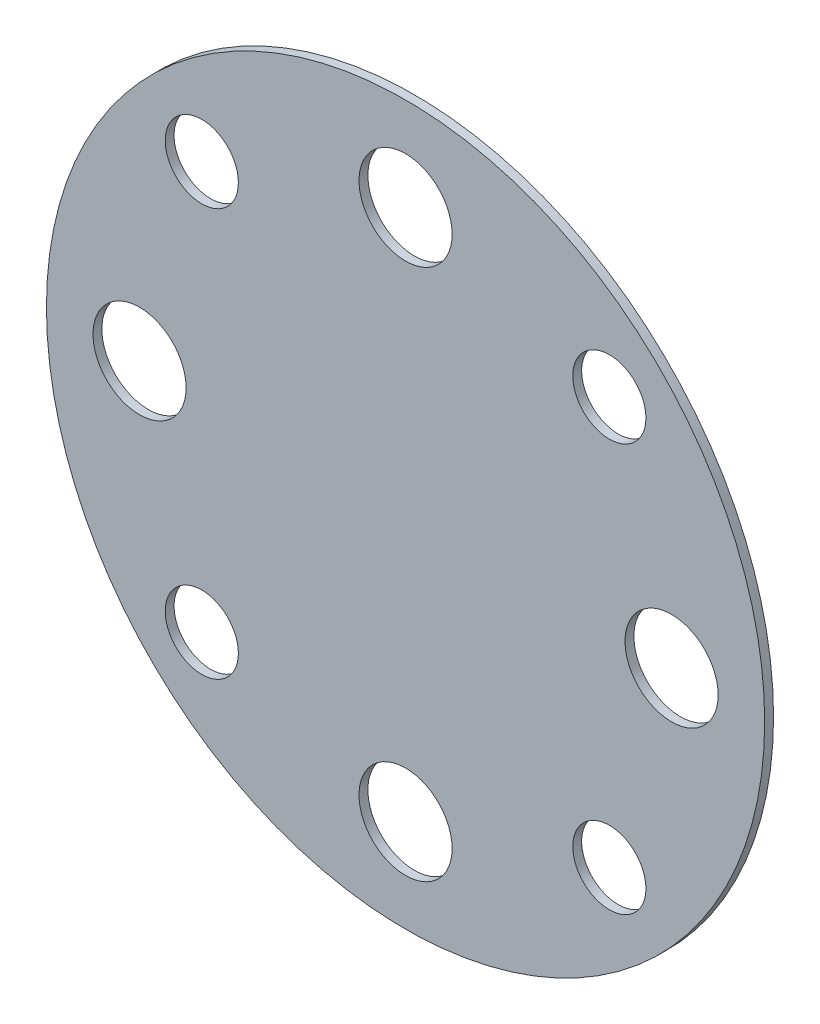
ISO-10303-21;
HEADER;
FILE_DESCRIPTION(('STEP AP214'),'2;1');
FILE_NAME('part.step','',(''),(''),'','','');
FILE_SCHEMA(('AUTOMOTIVE_DESIGN { 1 0 10303 214 1 1 1 1 }'));
ENDSEC;
DATA;
#1=APPLICATION_CONTEXT('core data for automotive mechanical design processes');
#2=APPLICATION_PROTOCOL_DEFINITION('international standard','automotive_design',2000,#1);
#3=PRODUCT_CONTEXT('',#1,'mechanical');
#4=PRODUCT('Part','Part','',(#3));
#5=PRODUCT_RELATED_PRODUCT_CATEGORY('part','',(#4));
#6=PRODUCT_DEFINITION_FORMATION('','',#4);
#7=PRODUCT_DEFINITION_CONTEXT('part definition',#1,'design');
#8=PRODUCT_DEFINITION('design','',#6,#7);
#9=PRODUCT_DEFINITION_SHAPE('','',#8);
#10=(LENGTH_UNIT() NAMED_UNIT(*) SI_UNIT(.MILLI.,.METRE.));
#11=(NAMED_UNIT(*) PLANE_ANGLE_UNIT() SI_UNIT($,.RADIAN.));
#12=(NAMED_UNIT(*) SI_UNIT($,.STERADIAN.) SOLID_ANGLE_UNIT());
#13=UNCERTAINTY_MEASURE_WITH_UNIT(LENGTH_MEASURE(1.E-05),#10,'distance_accuracy_value','');
#14=(GEOMETRIC_REPRESENTATION_CONTEXT(3) GLOBAL_UNCERTAINTY_ASSIGNED_CONTEXT((#13)) GLOBAL_UNIT_ASSIGNED_CONTEXT((#10,
#11,#12)) REPRESENTATION_CONTEXT('',''));
#15=CARTESIAN_POINT('',(0.,0.,0.));
#16=DIRECTION('',(0.,0.,1.));
#17=DIRECTION('',(1.,0.,0.));
#18=AXIS2_PLACEMENT_3D('',#15,#16,#17);
#19=CARTESIAN_POINT('',(0.,0.,0.4));
#20=DIRECTION('',(0.,0.,1.));
#21=DIRECTION('',(1.,0.,0.));
#22=AXIS2_PLACEMENT_3D('',#19,#20,#21);
#23=PLANE('',#22);
#24=CARTESIAN_POINT('',(-1.25693328198353E-13,-12.,0.4));
#25=DIRECTION('',(0.,0.,1.));
#26=DIRECTION('',(1.,0.,0.));
#27=AXIS2_PLACEMENT_3D('',#24,#25,#26);
#28=CIRCLE('',#27,2.1);
#29=CARTESIAN_POINT('',(2.09999999999987,-12.,0.4));
#30=VERTEX_POINT('',#29);
#31=EDGE_CURVE('E85',#30,#30,#28,.T.);
#32=ORIENTED_EDGE('',*,*,#31,.F.);
#33=EDGE_LOOP('',(#32));
#34=FACE_BOUND('',#33,.T.);
#35=CARTESIAN_POINT('',(12.,0.,0.4));
#36=DIRECTION('',(0.,0.,1.));
#37=DIRECTION('',(1.,0.,0.));
#38=AXIS2_PLACEMENT_3D('',#35,#36,#37);
#39=CIRCLE('',#38,2.1);
#40=CARTESIAN_POINT('',(14.1,0.,0.4));
#41=VERTEX_POINT('',#40);
#42=EDGE_CURVE('E73',#41,#41,#39,.T.);
#43=ORIENTED_EDGE('',*,*,#42,.F.);
#44=EDGE_LOOP('',(#43));
#45=FACE_BOUND('',#44,.T.);
#46=CARTESIAN_POINT('',(0.,12.,0.4));
#47=DIRECTION('',(0.,0.,1.));
#48=DIRECTION('',(1.,0.,0.));
#49=AXIS2_PLACEMENT_3D('',#46,#47,#48);
#50=CIRCLE('',#49,2.1);
#51=CARTESIAN_POINT('',(2.10000000000004,12.,0.4));
#52=VERTEX_POINT('',#51);
#53=EDGE_CURVE('E61',#52,#52,#50,.T.);
#54=ORIENTED_EDGE('',*,*,#53,.F.);
#55=EDGE_LOOP('',(#54));
#56=FACE_BOUND('',#55,.T.);
#57=CARTESIAN_POINT('',(-12.,0.,0.4));
#58=DIRECTION('',(0.,0.,1.));
#59=DIRECTION('',(1.,0.,0.));
#60=AXIS2_PLACEMENT_3D('',#57,#58,#59);
#61=CIRCLE('',#60,2.1);
#62=CARTESIAN_POINT('',(-9.9,0.,0.4));
#63=VERTEX_POINT('',#62);
#64=EDGE_CURVE('E50',#63,#63,#61,.T.);
#65=ORIENTED_EDGE('',*,*,#64,.F.);
#66=EDGE_LOOP('',(#65));
#67=FACE_BOUND('',#66,.T.);
#68=CARTESIAN_POINT('',(0.,0.,0.4));
#69=DIRECTION('',(0.,0.,1.));
#70=DIRECTION('',(1.,0.,0.));
#71=AXIS2_PLACEMENT_3D('',#68,#69,#70);
#72=CIRCLE('',#71,16.2);
#73=CARTESIAN_POINT('',(16.2,0.,0.4));
#74=VERTEX_POINT('',#73);
#75=EDGE_CURVE('E10',#74,#74,#72,.T.);
#76=ORIENTED_EDGE('',*,*,#75,.T.);
#77=EDGE_LOOP('',(#76));
#78=FACE_BOUND('',#77,.T.);
#79=CARTESIAN_POINT('',(-9.19238815542513,9.1923881554251,0.4));
#80=DIRECTION('',(0.,0.,1.));
#81=DIRECTION('',(1.,0.,0.));
#82=AXIS2_PLACEMENT_3D('',#79,#80,#81);
#83=CIRCLE('',#82,1.65);
#84=CARTESIAN_POINT('',(-7.54238815542513,9.1923881554251,0.4));
#85=VERTEX_POINT('',#84);
#86=EDGE_CURVE('E55',#85,#85,#83,.T.);
#87=ORIENTED_EDGE('',*,*,#86,.F.);
#88=EDGE_LOOP('',(#87));
#89=FACE_BOUND('',#88,.T.);
#90=CARTESIAN_POINT('',(9.19238815542513,9.1923881554251,0.4));
#91=DIRECTION('',(0.,0.,1.));
#92=DIRECTION('',(1.,0.,0.));
#93=AXIS2_PLACEMENT_3D('',#90,#91,#92);
#94=CIRCLE('',#93,1.65);
#95=CARTESIAN_POINT('',(10.8423881554251,9.1923881554251,0.4));
#96=VERTEX_POINT('',#95);
#97=EDGE_CURVE('E67',#96,#96,#94,.T.);
#98=ORIENTED_EDGE('',*,*,#97,.F.);
#99=EDGE_LOOP('',(#98));
#100=FACE_BOUND('',#99,.T.);
#101=CARTESIAN_POINT('',(9.19238815542507,-9.19238815542516,0.4));
#102=DIRECTION('',(0.,0.,1.));
#103=DIRECTION('',(1.,0.,0.));
#104=AXIS2_PLACEMENT_3D('',#101,#102,#103);
#105=CIRCLE('',#104,1.65);
#106=CARTESIAN_POINT('',(10.8423881554251,-9.19238815542516,0.4));
#107=VERTEX_POINT('',#106);
#108=EDGE_CURVE('E79',#107,#107,#105,.T.);
#109=ORIENTED_EDGE('',*,*,#108,.F.);
#110=EDGE_LOOP('',(#109));
#111=FACE_BOUND('',#110,.T.);
#112=CARTESIAN_POINT('',(-9.1923881554252,-9.19238815542504,0.4));
#113=DIRECTION('',(0.,0.,1.));
#114=DIRECTION('',(1.,0.,0.));
#115=AXIS2_PLACEMENT_3D('',#112,#113,#114);
#116=CIRCLE('',#115,1.65);
#117=CARTESIAN_POINT('',(-7.5423881554252,-9.19238815542504,0.4));
#118=VERTEX_POINT('',#117);
#119=EDGE_CURVE('E91',#118,#118,#116,.T.);
#120=ORIENTED_EDGE('',*,*,#119,.F.);
#121=EDGE_LOOP('',(#120));
#122=FACE_BOUND('',#121,.T.);
#123=ADVANCED_FACE('F39',(#34,#45,#56,#67,#78,#89,#100,#111,#122),#23,.T.);
#124=CARTESIAN_POINT('',(0.,0.,0.));
#125=DIRECTION('',(0.,0.,1.));
#126=DIRECTION('',(1.,0.,0.));
#127=AXIS2_PLACEMENT_3D('',#124,#125,#126);
#128=PLANE('',#127);
#129=CARTESIAN_POINT('',(0.,0.,0.));
#130=DIRECTION('',(0.,0.,1.));
#131=DIRECTION('',(1.,0.,0.));
#132=AXIS2_PLACEMENT_3D('',#129,#130,#131);
#133=CIRCLE('',#132,16.2);
#134=CARTESIAN_POINT('',(16.2,0.,0.));
#135=VERTEX_POINT('',#134);
#136=EDGE_CURVE('E43',#135,#135,#133,.T.);
#137=ORIENTED_EDGE('',*,*,#136,.F.);
#138=EDGE_LOOP('',(#137));
#139=FACE_BOUND('',#138,.T.);
#140=CARTESIAN_POINT('',(-12.,0.,0.));
#141=DIRECTION('',(0.,0.,1.));
#142=DIRECTION('',(1.,0.,0.));
#143=AXIS2_PLACEMENT_3D('',#140,#141,#142);
#144=CIRCLE('',#143,2.1);
#145=CARTESIAN_POINT('',(-9.9,0.,0.));
#146=VERTEX_POINT('',#145);
#147=EDGE_CURVE('E52',#146,#146,#144,.T.);
#148=ORIENTED_EDGE('',*,*,#147,.T.);
#149=EDGE_LOOP('',(#148));
#150=FACE_BOUND('',#149,.T.);
#151=CARTESIAN_POINT('',(-9.19238815542513,9.1923881554251,0.));
#152=DIRECTION('',(0.,0.,1.));
#153=DIRECTION('',(1.,0.,0.));
#154=AXIS2_PLACEMENT_3D('',#151,#152,#153);
#155=CIRCLE('',#154,1.65);
#156=CARTESIAN_POINT('',(-7.54238815542513,9.1923881554251,0.));
#157=VERTEX_POINT('',#156);
#158=EDGE_CURVE('E58',#157,#157,#155,.T.);
#159=ORIENTED_EDGE('',*,*,#158,.T.);
#160=EDGE_LOOP('',(#159));
#161=FACE_BOUND('',#160,.T.);
#162=CARTESIAN_POINT('',(0.,12.,0.));
#163=DIRECTION('',(0.,0.,1.));
#164=DIRECTION('',(1.,0.,0.));
#165=AXIS2_PLACEMENT_3D('',#162,#163,#164);
#166=CIRCLE('',#165,2.1);
#167=CARTESIAN_POINT('',(2.10000000000004,12.,0.));
#168=VERTEX_POINT('',#167);
#169=EDGE_CURVE('E64',#168,#168,#166,.T.);
#170=ORIENTED_EDGE('',*,*,#169,.T.);
#171=EDGE_LOOP('',(#170));
#172=FACE_BOUND('',#171,.T.);
#173=CARTESIAN_POINT('',(9.19238815542513,9.1923881554251,0.));
#174=DIRECTION('',(0.,0.,1.));
#175=DIRECTION('',(1.,0.,0.));
#176=AXIS2_PLACEMENT_3D('',#173,#174,#175);
#177=CIRCLE('',#176,1.65);
#178=CARTESIAN_POINT('',(10.8423881554251,9.1923881554251,0.));
#179=VERTEX_POINT('',#178);
#180=EDGE_CURVE('E70',#179,#179,#177,.T.);
#181=ORIENTED_EDGE('',*,*,#180,.T.);
#182=EDGE_LOOP('',(#181));
#183=FACE_BOUND('',#182,.T.);
#184=CARTESIAN_POINT('',(12.,0.,0.));
#185=DIRECTION('',(0.,0.,1.));
#186=DIRECTION('',(1.,0.,0.));
#187=AXIS2_PLACEMENT_3D('',#184,#185,#186);
#188=CIRCLE('',#187,2.1);
#189=CARTESIAN_POINT('',(14.1,0.,0.));
#190=VERTEX_POINT('',#189);
#191=EDGE_CURVE('E76',#190,#190,#188,.T.);
#192=ORIENTED_EDGE('',*,*,#191,.T.);
#193=EDGE_LOOP('',(#192));
#194=FACE_BOUND('',#193,.T.);
#195=CARTESIAN_POINT('',(9.19238815542507,-9.19238815542516,0.));
#196=DIRECTION('',(0.,0.,1.));
#197=DIRECTION('',(1.,0.,0.));
#198=AXIS2_PLACEMENT_3D('',#195,#196,#197);
#199=CIRCLE('',#198,1.65);
#200=CARTESIAN_POINT('',(10.8423881554251,-9.19238815542516,0.));
#201=VERTEX_POINT('',#200);
#202=EDGE_CURVE('E82',#201,#201,#199,.T.);
#203=ORIENTED_EDGE('',*,*,#202,.T.);
#204=EDGE_LOOP('',(#203));
#205=FACE_BOUND('',#204,.T.);
#206=CARTESIAN_POINT('',(-1.25693328198353E-13,-12.,0.));
#207=DIRECTION('',(0.,0.,1.));
#208=DIRECTION('',(1.,0.,0.));
#209=AXIS2_PLACEMENT_3D('',#206,#207,#208);
#210=CIRCLE('',#209,2.1);
#211=CARTESIAN_POINT('',(2.09999999999987,-12.,0.));
#212=VERTEX_POINT('',#211);
#213=EDGE_CURVE('E88',#212,#212,#210,.T.);
#214=ORIENTED_EDGE('',*,*,#213,.T.);
#215=EDGE_LOOP('',(#214));
#216=FACE_BOUND('',#215,.T.);
#217=CARTESIAN_POINT('',(-9.1923881554252,-9.19238815542504,0.));
#218=DIRECTION('',(0.,0.,1.));
#219=DIRECTION('',(1.,0.,0.));
#220=AXIS2_PLACEMENT_3D('',#217,#218,#219);
#221=CIRCLE('',#220,1.65);
#222=CARTESIAN_POINT('',(-7.5423881554252,-9.19238815542504,0.));
#223=VERTEX_POINT('',#222);
#224=EDGE_CURVE('E94',#223,#223,#221,.T.);
#225=ORIENTED_EDGE('',*,*,#224,.T.);
#226=EDGE_LOOP('',(#225));
#227=FACE_BOUND('',#226,.T.);
#228=ADVANCED_FACE('F104',(#139,#150,#161,#172,#183,#194,#205,#216,#227),#128,.F.);
#229=CARTESIAN_POINT('',(0.,0.,0.4));
#230=DIRECTION('',(0.,0.,-1.));
#231=DIRECTION('',(-1.,0.,0.));
#232=AXIS2_PLACEMENT_3D('',#229,#230,#231);
#233=CYLINDRICAL_SURFACE('',#232,16.2);
#234=ORIENTED_EDGE('',*,*,#75,.F.);
#235=EDGE_LOOP('',(#234));
#236=FACE_BOUND('',#235,.T.);
#237=ORIENTED_EDGE('',*,*,#136,.T.);
#238=EDGE_LOOP('',(#237));
#239=FACE_BOUND('',#238,.T.);
#240=ADVANCED_FACE('F41',(#236,#239),#233,.T.);
#241=CARTESIAN_POINT('',(-12.,0.,0.4));
#242=DIRECTION('',(0.,0.,-1.));
#243=DIRECTION('',(-1.,0.,0.));
#244=AXIS2_PLACEMENT_3D('',#241,#242,#243);
#245=CYLINDRICAL_SURFACE('',#244,2.1);
#246=ORIENTED_EDGE('',*,*,#64,.T.);
#247=EDGE_LOOP('',(#246));
#248=FACE_BOUND('',#247,.T.);
#249=ORIENTED_EDGE('',*,*,#147,.F.);
#250=EDGE_LOOP('',(#249));
#251=FACE_BOUND('',#250,.T.);
#252=ADVANCED_FACE('F114',(#248,#251),#245,.F.);
#253=CARTESIAN_POINT('',(-9.19238815542513,9.1923881554251,0.4));
#254=DIRECTION('',(0.,0.,-1.));
#255=DIRECTION('',(-1.,0.,0.));
#256=AXIS2_PLACEMENT_3D('',#253,#254,#255);
#257=CYLINDRICAL_SURFACE('',#256,1.65);
#258=ORIENTED_EDGE('',*,*,#86,.T.);
#259=EDGE_LOOP('',(#258));
#260=FACE_BOUND('',#259,.T.);
#261=ORIENTED_EDGE('',*,*,#158,.F.);
#262=EDGE_LOOP('',(#261));
#263=FACE_BOUND('',#262,.T.);
#264=ADVANCED_FACE('F117',(#260,#263),#257,.F.);
#265=CARTESIAN_POINT('',(0.,12.,0.4));
#266=DIRECTION('',(0.,0.,-1.));
#267=DIRECTION('',(-1.,0.,0.));
#268=AXIS2_PLACEMENT_3D('',#265,#266,#267);
#269=CYLINDRICAL_SURFACE('',#268,2.1);
#270=ORIENTED_EDGE('',*,*,#53,.T.);
#271=EDGE_LOOP('',(#270));
#272=FACE_BOUND('',#271,.T.);
#273=ORIENTED_EDGE('',*,*,#169,.F.);
#274=EDGE_LOOP('',(#273));
#275=FACE_BOUND('',#274,.T.);
#276=ADVANCED_FACE('F121',(#272,#275),#269,.F.);
#277=CARTESIAN_POINT('',(9.19238815542513,9.1923881554251,0.4));
#278=DIRECTION('',(0.,0.,-1.));
#279=DIRECTION('',(-1.,0.,0.));
#280=AXIS2_PLACEMENT_3D('',#277,#278,#279);
#281=CYLINDRICAL_SURFACE('',#280,1.65);
#282=ORIENTED_EDGE('',*,*,#97,.T.);
#283=EDGE_LOOP('',(#282));
#284=FACE_BOUND('',#283,.T.);
#285=ORIENTED_EDGE('',*,*,#180,.F.);
#286=EDGE_LOOP('',(#285));
#287=FACE_BOUND('',#286,.T.);
#288=ADVANCED_FACE('F125',(#284,#287),#281,.F.);
#289=CARTESIAN_POINT('',(12.,0.,0.4));
#290=DIRECTION('',(0.,0.,-1.));
#291=DIRECTION('',(-1.,0.,0.));
#292=AXIS2_PLACEMENT_3D('',#289,#290,#291);
#293=CYLINDRICAL_SURFACE('',#292,2.1);
#294=ORIENTED_EDGE('',*,*,#42,.T.);
#295=EDGE_LOOP('',(#294));
#296=FACE_BOUND('',#295,.T.);
#297=ORIENTED_EDGE('',*,*,#191,.F.);
#298=EDGE_LOOP('',(#297));
#299=FACE_BOUND('',#298,.T.);
#300=ADVANCED_FACE('F129',(#296,#299),#293,.F.);
#301=CARTESIAN_POINT('',(9.19238815542507,-9.19238815542516,0.4));
#302=DIRECTION('',(0.,0.,-1.));
#303=DIRECTION('',(-1.,0.,0.));
#304=AXIS2_PLACEMENT_3D('',#301,#302,#303);
#305=CYLINDRICAL_SURFACE('',#304,1.65);
#306=ORIENTED_EDGE('',*,*,#108,.T.);
#307=EDGE_LOOP('',(#306));
#308=FACE_BOUND('',#307,.T.);
#309=ORIENTED_EDGE('',*,*,#202,.F.);
#310=EDGE_LOOP('',(#309));
#311=FACE_BOUND('',#310,.T.);
#312=ADVANCED_FACE('F133',(#308,#311),#305,.F.);
#313=CARTESIAN_POINT('',(-1.25693328198353E-13,-12.,0.4));
#314=DIRECTION('',(0.,0.,-1.));
#315=DIRECTION('',(-1.,0.,0.));
#316=AXIS2_PLACEMENT_3D('',#313,#314,#315);
#317=CYLINDRICAL_SURFACE('',#316,2.1);
#318=ORIENTED_EDGE('',*,*,#31,.T.);
#319=EDGE_LOOP('',(#318));
#320=FACE_BOUND('',#319,.T.);
#321=ORIENTED_EDGE('',*,*,#213,.F.);
#322=EDGE_LOOP('',(#321));
#323=FACE_BOUND('',#322,.T.);
#324=ADVANCED_FACE('F137',(#320,#323),#317,.F.);
#325=CARTESIAN_POINT('',(-9.1923881554252,-9.19238815542504,0.4));
#326=DIRECTION('',(0.,0.,-1.));
#327=DIRECTION('',(-1.,0.,0.));
#328=AXIS2_PLACEMENT_3D('',#325,#326,#327);
#329=CYLINDRICAL_SURFACE('',#328,1.65);
#330=ORIENTED_EDGE('',*,*,#119,.T.);
#331=EDGE_LOOP('',(#330));
#332=FACE_BOUND('',#331,.T.);
#333=ORIENTED_EDGE('',*,*,#224,.F.);
#334=EDGE_LOOP('',(#333));
#335=FACE_BOUND('',#334,.T.);
#336=ADVANCED_FACE('F100',(#332,#335),#329,.F.);
#337=CLOSED_SHELL('',(#123,#228,#240,#252,#264,#276,#288,#300,#312,#324,#336));
#338=MANIFOLD_SOLID_BREP('B2',#337);
#339=ADVANCED_BREP_SHAPE_REPRESENTATION('',(#18,#338),#14);
#340=SHAPE_DEFINITION_REPRESENTATION(#9,#339);
ENDSEC;
END-ISO-10303-21;
